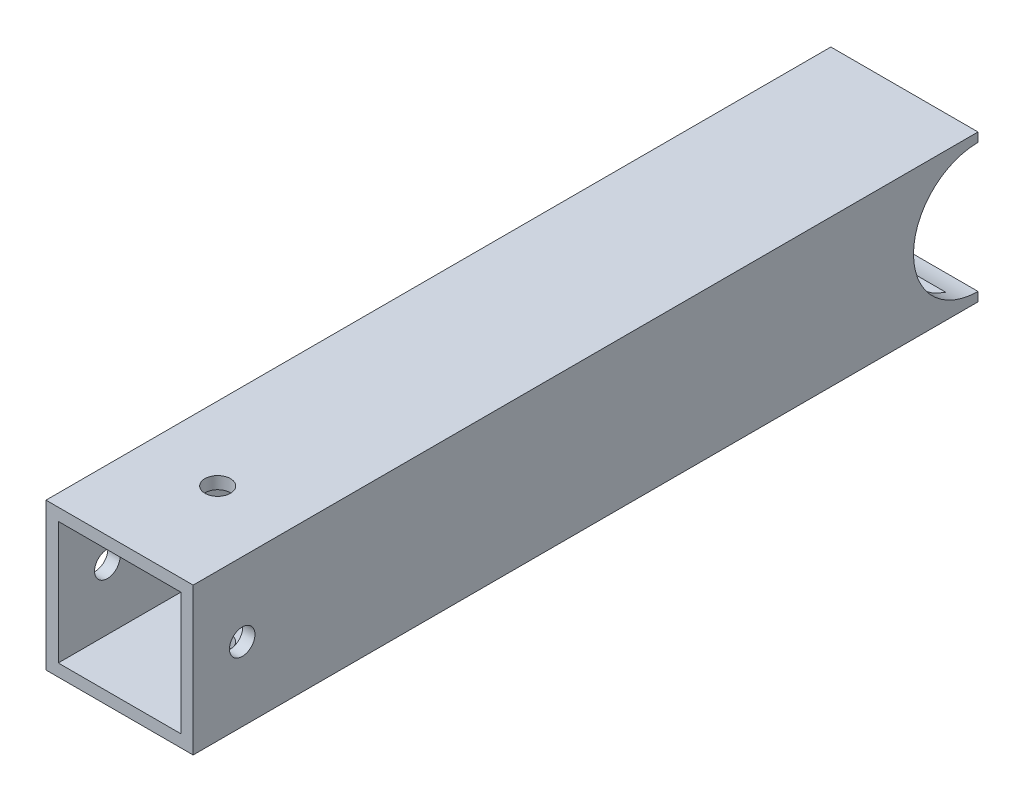
ISO-10303-21;
HEADER;
FILE_DESCRIPTION(('STEP AP214'),'2;1');
FILE_NAME('part.step','',(''),(''),'','','');
FILE_SCHEMA(('AUTOMOTIVE_DESIGN { 1 0 10303 214 1 1 1 1 }'));
ENDSEC;
DATA;
#1=APPLICATION_CONTEXT('core data for automotive mechanical design processes');
#2=APPLICATION_PROTOCOL_DEFINITION('international standard','automotive_design',2000,#1);
#3=PRODUCT_CONTEXT('',#1,'mechanical');
#4=PRODUCT('Part','Part','',(#3));
#5=PRODUCT_RELATED_PRODUCT_CATEGORY('part','',(#4));
#6=PRODUCT_DEFINITION_FORMATION('','',#4);
#7=PRODUCT_DEFINITION_CONTEXT('part definition',#1,'design');
#8=PRODUCT_DEFINITION('design','',#6,#7);
#9=PRODUCT_DEFINITION_SHAPE('','',#8);
#10=(LENGTH_UNIT() NAMED_UNIT(*) SI_UNIT(.MILLI.,.METRE.));
#11=(NAMED_UNIT(*) PLANE_ANGLE_UNIT() SI_UNIT($,.RADIAN.));
#12=(NAMED_UNIT(*) SI_UNIT($,.STERADIAN.) SOLID_ANGLE_UNIT());
#13=UNCERTAINTY_MEASURE_WITH_UNIT(LENGTH_MEASURE(1.E-05),#10,'distance_accuracy_value','');
#14=(GEOMETRIC_REPRESENTATION_CONTEXT(3) GLOBAL_UNCERTAINTY_ASSIGNED_CONTEXT((#13)) GLOBAL_UNIT_ASSIGNED_CONTEXT((#10,
#11,#12)) REPRESENTATION_CONTEXT('',''));
#15=CARTESIAN_POINT('',(0.,0.,0.));
#16=DIRECTION('',(0.,0.,1.));
#17=DIRECTION('',(1.,0.,0.));
#18=AXIS2_PLACEMENT_3D('',#15,#16,#17);
#19=CARTESIAN_POINT('',(0.,22.86,76.2));
#20=DIRECTION('',(0.,-1.,0.));
#21=DIRECTION('',(0.,0.,-1.));
#22=AXIS2_PLACEMENT_3D('',#19,#20,#21);
#23=CYLINDRICAL_SURFACE('',#22,3.302);
#24=CARTESIAN_POINT('',(0.,15.875,76.2));
#25=DIRECTION('',(0.,-1.,0.));
#26=DIRECTION('',(0.,0.,-1.));
#27=AXIS2_PLACEMENT_3D('',#24,#25,#26);
#28=CIRCLE('',#27,3.302);
#29=CARTESIAN_POINT('',(0.,15.875,72.898));
#30=VERTEX_POINT('',#29);
#31=EDGE_CURVE('E130',#30,#30,#28,.F.);
#32=ORIENTED_EDGE('',*,*,#31,.F.);
#33=EDGE_LOOP('',(#32));
#34=FACE_BOUND('',#33,.T.);
#35=CARTESIAN_POINT('',(0.,19.05,76.2));
#36=DIRECTION('',(0.,-1.,0.));
#37=DIRECTION('',(0.,0.,-1.));
#38=AXIS2_PLACEMENT_3D('',#35,#36,#37);
#39=CIRCLE('',#38,3.302);
#40=CARTESIAN_POINT('',(0.,19.05,72.898));
#41=VERTEX_POINT('',#40);
#42=EDGE_CURVE('E128',#41,#41,#39,.T.);
#43=ORIENTED_EDGE('',*,*,#42,.F.);
#44=EDGE_LOOP('',(#43));
#45=FACE_BOUND('',#44,.T.);
#46=ADVANCED_FACE('F17',(#34,#45),#23,.F.);
#47=CARTESIAN_POINT('',(22.86,0.,88.9));
#48=DIRECTION('',(-1.,0.,0.));
#49=DIRECTION('',(0.,0.,1.));
#50=AXIS2_PLACEMENT_3D('',#47,#48,#49);
#51=CYLINDRICAL_SURFACE('',#50,3.302);
#52=CARTESIAN_POINT('',(15.875,0.,88.9));
#53=DIRECTION('',(-1.,0.,0.));
#54=DIRECTION('',(0.,0.,1.));
#55=AXIS2_PLACEMENT_3D('',#52,#53,#54);
#56=CIRCLE('',#55,3.302);
#57=CARTESIAN_POINT('',(15.875,0.,92.202));
#58=VERTEX_POINT('',#57);
#59=EDGE_CURVE('E20',#58,#58,#56,.F.);
#60=ORIENTED_EDGE('',*,*,#59,.F.);
#61=EDGE_LOOP('',(#60));
#62=FACE_BOUND('',#61,.T.);
#63=CARTESIAN_POINT('',(19.05,0.,88.9));
#64=DIRECTION('',(-1.,0.,0.));
#65=DIRECTION('',(0.,0.,1.));
#66=AXIS2_PLACEMENT_3D('',#63,#64,#65);
#67=CIRCLE('',#66,3.302);
#68=CARTESIAN_POINT('',(19.05,0.,92.202));
#69=VERTEX_POINT('',#68);
#70=EDGE_CURVE('E161',#69,#69,#67,.T.);
#71=ORIENTED_EDGE('',*,*,#70,.F.);
#72=EDGE_LOOP('',(#71));
#73=FACE_BOUND('',#72,.T.);
#74=ADVANCED_FACE('F338',(#62,#73),#51,.F.);
#75=CARTESIAN_POINT('',(15.875,15.875,-101.6));
#76=DIRECTION('',(-1.,0.,0.));
#77=DIRECTION('',(0.,0.,1.));
#78=AXIS2_PLACEMENT_3D('',#75,#76,#77);
#79=PLANE('',#78);
#80=ORIENTED_EDGE('',*,*,#59,.T.);
#81=EDGE_LOOP('',(#80));
#82=FACE_BOUND('',#81,.T.);
#83=DIRECTION('',(0.,0.,-1.));
#84=VECTOR('',#83,1.);
#85=CARTESIAN_POINT('',(15.875,15.875,-101.6));
#86=LINE('',#85,#84);
#87=CARTESIAN_POINT('',(15.875,15.8750000000009,-96.4143394586638));
#88=VERTEX_POINT('',#87);
#89=CARTESIAN_POINT('',(15.875,15.875,101.6));
#90=VERTEX_POINT('',#89);
#91=EDGE_CURVE('E91',#88,#90,#86,.F.);
#92=ORIENTED_EDGE('',*,*,#91,.F.);
#93=CARTESIAN_POINT('',(15.875,0.,-101.6));
#94=DIRECTION('',(1.,0.,0.));
#95=DIRECTION('',(0.,0.,-1.));
#96=AXIS2_PLACEMENT_3D('',#93,#94,#95);
#97=CIRCLE('',#96,16.7005);
#98=CARTESIAN_POINT('',(15.875,-15.875,-96.4143394586641));
#99=VERTEX_POINT('',#98);
#100=EDGE_CURVE('E95',#88,#99,#97,.T.);
#101=ORIENTED_EDGE('',*,*,#100,.T.);
#102=DIRECTION('',(0.,0.,1.));
#103=VECTOR('',#102,1.);
#104=CARTESIAN_POINT('',(15.875,-15.875,-101.6));
#105=LINE('',#104,#103);
#106=CARTESIAN_POINT('',(15.875,-15.875,101.6));
#107=VERTEX_POINT('',#106);
#108=EDGE_CURVE('E182',#107,#99,#105,.F.);
#109=ORIENTED_EDGE('',*,*,#108,.F.);
#110=DIRECTION('',(0.,1.,0.));
#111=VECTOR('',#110,1.);
#112=CARTESIAN_POINT('',(15.875,0.,101.6));
#113=LINE('',#112,#111);
#114=EDGE_CURVE('E98',#90,#107,#113,.F.);
#115=ORIENTED_EDGE('',*,*,#114,.F.);
#116=EDGE_LOOP('',(#92,#101,#109,#115));
#117=FACE_BOUND('',#116,.T.);
#118=ADVANCED_FACE('F93',(#82,#117),#79,.T.);
#119=CARTESIAN_POINT('',(-15.875,-15.875,-101.6));
#120=DIRECTION('',(1.,0.,0.));
#121=DIRECTION('',(0.,0.,-1.));
#122=AXIS2_PLACEMENT_3D('',#119,#120,#121);
#123=PLANE('',#122);
#124=CARTESIAN_POINT('',(-15.875,0.,88.9));
#125=DIRECTION('',(-1.,0.,0.));
#126=DIRECTION('',(0.,0.,1.));
#127=AXIS2_PLACEMENT_3D('',#124,#125,#126);
#128=CIRCLE('',#127,3.302);
#129=CARTESIAN_POINT('',(-15.875,0.,92.202));
#130=VERTEX_POINT('',#129);
#131=EDGE_CURVE('E121',#130,#130,#128,.T.);
#132=ORIENTED_EDGE('',*,*,#131,.T.);
#133=EDGE_LOOP('',(#132));
#134=FACE_BOUND('',#133,.T.);
#135=DIRECTION('',(0.,0.,1.));
#136=VECTOR('',#135,1.);
#137=CARTESIAN_POINT('',(-15.875,-15.875,-101.6));
#138=LINE('',#137,#136);
#139=CARTESIAN_POINT('',(-15.875,-15.875,-96.4143394586641));
#140=VERTEX_POINT('',#139);
#141=CARTESIAN_POINT('',(-15.875,-15.875,101.6));
#142=VERTEX_POINT('',#141);
#143=EDGE_CURVE('E110',#140,#142,#138,.T.);
#144=ORIENTED_EDGE('',*,*,#143,.F.);
#145=CARTESIAN_POINT('',(-15.875,0.,-101.6));
#146=DIRECTION('',(1.,0.,0.));
#147=DIRECTION('',(0.,0.,-1.));
#148=AXIS2_PLACEMENT_3D('',#145,#146,#147);
#149=CIRCLE('',#148,16.7005);
#150=CARTESIAN_POINT('',(-15.875,15.8750000000009,-96.4143394586638));
#151=VERTEX_POINT('',#150);
#152=EDGE_CURVE('E111',#140,#151,#149,.F.);
#153=ORIENTED_EDGE('',*,*,#152,.T.);
#154=DIRECTION('',(0.,0.,-1.));
#155=VECTOR('',#154,1.);
#156=CARTESIAN_POINT('',(-15.875,15.875,-101.6));
#157=LINE('',#156,#155);
#158=CARTESIAN_POINT('',(-15.875,15.875,101.6));
#159=VERTEX_POINT('',#158);
#160=EDGE_CURVE('E102',#159,#151,#157,.T.);
#161=ORIENTED_EDGE('',*,*,#160,.F.);
#162=DIRECTION('',(0.,1.,0.));
#163=VECTOR('',#162,1.);
#164=CARTESIAN_POINT('',(-15.875,0.,101.6));
#165=LINE('',#164,#163);
#166=EDGE_CURVE('E146',#142,#159,#165,.T.);
#167=ORIENTED_EDGE('',*,*,#166,.F.);
#168=EDGE_LOOP('',(#144,#153,#161,#167));
#169=FACE_BOUND('',#168,.T.);
#170=ADVANCED_FACE('F204',(#134,#169),#123,.T.);
#171=CARTESIAN_POINT('',(-15.875,15.875,-101.6));
#172=DIRECTION('',(0.,-1.,0.));
#173=DIRECTION('',(0.,0.,-1.));
#174=AXIS2_PLACEMENT_3D('',#171,#172,#173);
#175=PLANE('',#174);
#176=ORIENTED_EDGE('',*,*,#31,.T.);
#177=EDGE_LOOP('',(#176));
#178=FACE_BOUND('',#177,.T.);
#179=ORIENTED_EDGE('',*,*,#160,.T.);
#180=DIRECTION('',(1.,0.,0.));
#181=VECTOR('',#180,1.);
#182=CARTESIAN_POINT('',(19.05,15.8750000000018,-96.4143394586666));
#183=LINE('',#182,#181);
#184=EDGE_CURVE('E106',#151,#88,#183,.T.);
#185=ORIENTED_EDGE('',*,*,#184,.T.);
#186=ORIENTED_EDGE('',*,*,#91,.T.);
#187=DIRECTION('',(1.,0.,0.));
#188=VECTOR('',#187,1.);
#189=CARTESIAN_POINT('',(0.,15.875,101.6));
#190=LINE('',#189,#188);
#191=EDGE_CURVE('E143',#159,#90,#190,.T.);
#192=ORIENTED_EDGE('',*,*,#191,.F.);
#193=EDGE_LOOP('',(#179,#185,#186,#192));
#194=FACE_BOUND('',#193,.T.);
#195=ADVANCED_FACE('F107',(#178,#194),#175,.T.);
#196=CARTESIAN_POINT('',(19.05,19.05,-101.6));
#197=DIRECTION('',(0.,1.,0.));
#198=DIRECTION('',(0.,0.,1.));
#199=AXIS2_PLACEMENT_3D('',#196,#197,#198);
#200=PLANE('',#199);
#201=ORIENTED_EDGE('',*,*,#42,.T.);
#202=EDGE_LOOP('',(#201));
#203=FACE_BOUND('',#202,.T.);
#204=DIRECTION('',(0.,0.,-1.));
#205=VECTOR('',#204,1.);
#206=CARTESIAN_POINT('',(19.05,19.05,-101.6));
#207=LINE('',#206,#205);
#208=CARTESIAN_POINT('',(19.05,19.05,-101.6));
#209=VERTEX_POINT('',#208);
#210=CARTESIAN_POINT('',(19.05,19.05,101.6));
#211=VERTEX_POINT('',#210);
#212=EDGE_CURVE('E166',#209,#211,#207,.F.);
#213=ORIENTED_EDGE('',*,*,#212,.F.);
#214=DIRECTION('',(1.,0.,0.));
#215=VECTOR('',#214,1.);
#216=CARTESIAN_POINT('',(0.,19.05,-101.6));
#217=LINE('',#216,#215);
#218=CARTESIAN_POINT('',(-19.05,19.05,-101.6));
#219=VERTEX_POINT('',#218);
#220=EDGE_CURVE('E127',#209,#219,#217,.F.);
#221=ORIENTED_EDGE('',*,*,#220,.T.);
#222=DIRECTION('',(0.,0.,1.));
#223=VECTOR('',#222,1.);
#224=CARTESIAN_POINT('',(-19.05,19.05,-101.6));
#225=LINE('',#224,#223);
#226=CARTESIAN_POINT('',(-19.05,19.05,101.6));
#227=VERTEX_POINT('',#226);
#228=EDGE_CURVE('E376',#227,#219,#225,.F.);
#229=ORIENTED_EDGE('',*,*,#228,.F.);
#230=DIRECTION('',(1.,0.,0.));
#231=VECTOR('',#230,1.);
#232=CARTESIAN_POINT('',(0.,19.05,101.6));
#233=LINE('',#232,#231);
#234=EDGE_CURVE('E192',#211,#227,#233,.F.);
#235=ORIENTED_EDGE('',*,*,#234,.F.);
#236=EDGE_LOOP('',(#213,#221,#229,#235));
#237=FACE_BOUND('',#236,.T.);
#238=ADVANCED_FACE('F306',(#203,#237),#200,.T.);
#239=CARTESIAN_POINT('',(0.,0.,-101.6));
#240=DIRECTION('',(0.,0.,1.));
#241=DIRECTION('',(1.,0.,0.));
#242=AXIS2_PLACEMENT_3D('',#239,#240,#241);
#243=PLANE('',#242);
#244=ORIENTED_EDGE('',*,*,#220,.F.);
#245=DIRECTION('',(0.,1.,0.));
#246=VECTOR('',#245,1.);
#247=CARTESIAN_POINT('',(19.05,-19.05,-101.6));
#248=LINE('',#247,#246);
#249=CARTESIAN_POINT('',(19.05,16.7005,-101.6));
#250=VERTEX_POINT('',#249);
#251=EDGE_CURVE('E170',#250,#209,#248,.T.);
#252=ORIENTED_EDGE('',*,*,#251,.F.);
#253=DIRECTION('',(1.,0.,0.));
#254=VECTOR('',#253,1.);
#255=CARTESIAN_POINT('',(19.05,16.7005,-101.6));
#256=LINE('',#255,#254);
#257=CARTESIAN_POINT('',(-19.05,16.7005,-101.6));
#258=VERTEX_POINT('',#257);
#259=EDGE_CURVE('E118',#250,#258,#256,.F.);
#260=ORIENTED_EDGE('',*,*,#259,.T.);
#261=DIRECTION('',(0.,1.,0.));
#262=VECTOR('',#261,1.);
#263=CARTESIAN_POINT('',(-19.05,19.05,-101.6));
#264=LINE('',#263,#262);
#265=EDGE_CURVE('E160',#219,#258,#264,.F.);
#266=ORIENTED_EDGE('',*,*,#265,.F.);
#267=EDGE_LOOP('',(#244,#252,#260,#266));
#268=FACE_BOUND('',#267,.T.);
#269=ADVANCED_FACE('F297',(#268),#243,.F.);
#270=CARTESIAN_POINT('',(22.86,0.,88.9));
#271=DIRECTION('',(-1.,0.,0.));
#272=DIRECTION('',(0.,0.,1.));
#273=AXIS2_PLACEMENT_3D('',#270,#271,#272);
#274=CYLINDRICAL_SURFACE('',#273,3.302);
#275=ORIENTED_EDGE('',*,*,#131,.F.);
#276=EDGE_LOOP('',(#275));
#277=FACE_BOUND('',#276,.T.);
#278=CARTESIAN_POINT('',(-19.05,0.,88.9));
#279=DIRECTION('',(-1.,0.,0.));
#280=DIRECTION('',(0.,0.,1.));
#281=AXIS2_PLACEMENT_3D('',#278,#279,#280);
#282=CIRCLE('',#281,3.302);
#283=CARTESIAN_POINT('',(-19.05,0.,92.202));
#284=VERTEX_POINT('',#283);
#285=EDGE_CURVE('E154',#284,#284,#282,.F.);
#286=ORIENTED_EDGE('',*,*,#285,.F.);
#287=EDGE_LOOP('',(#286));
#288=FACE_BOUND('',#287,.T.);
#289=ADVANCED_FACE('F218',(#277,#288),#274,.F.);
#290=CARTESIAN_POINT('',(19.05,0.,-101.6));
#291=DIRECTION('',(1.,0.,0.));
#292=DIRECTION('',(0.,0.,-1.));
#293=AXIS2_PLACEMENT_3D('',#290,#291,#292);
#294=CYLINDRICAL_SURFACE('',#293,16.7005);
#295=ORIENTED_EDGE('',*,*,#152,.F.);
#296=DIRECTION('',(1.,0.,0.));
#297=VECTOR('',#296,1.);
#298=CARTESIAN_POINT('',(15.875,-15.875,-96.4143394586672));
#299=LINE('',#298,#297);
#300=EDGE_CURVE('E116',#99,#140,#299,.F.);
#301=ORIENTED_EDGE('',*,*,#300,.F.);
#302=ORIENTED_EDGE('',*,*,#100,.F.);
#303=ORIENTED_EDGE('',*,*,#184,.F.);
#304=EDGE_LOOP('',(#295,#301,#302,#303));
#305=FACE_BOUND('',#304,.T.);
#306=CARTESIAN_POINT('',(19.05,0.,-101.6));
#307=DIRECTION('',(1.,0.,0.));
#308=DIRECTION('',(0.,0.,-1.));
#309=AXIS2_PLACEMENT_3D('',#306,#307,#308);
#310=CIRCLE('',#309,16.7005);
#311=CARTESIAN_POINT('',(19.05,-16.7005,-101.6));
#312=VERTEX_POINT('',#311);
#313=EDGE_CURVE('E164',#312,#250,#310,.F.);
#314=ORIENTED_EDGE('',*,*,#313,.F.);
#315=DIRECTION('',(1.,0.,0.));
#316=VECTOR('',#315,1.);
#317=CARTESIAN_POINT('',(0.,-16.7005,-101.6));
#318=LINE('',#317,#316);
#319=CARTESIAN_POINT('',(-19.05,-16.7005,-101.6));
#320=VERTEX_POINT('',#319);
#321=EDGE_CURVE('E157',#312,#320,#318,.F.);
#322=ORIENTED_EDGE('',*,*,#321,.T.);
#323=CARTESIAN_POINT('',(-19.05,0.,-101.6));
#324=DIRECTION('',(1.,0.,0.));
#325=DIRECTION('',(0.,0.,-1.));
#326=AXIS2_PLACEMENT_3D('',#323,#324,#325);
#327=CIRCLE('',#326,16.7005);
#328=EDGE_CURVE('E158',#258,#320,#327,.T.);
#329=ORIENTED_EDGE('',*,*,#328,.F.);
#330=ORIENTED_EDGE('',*,*,#259,.F.);
#331=EDGE_LOOP('',(#314,#322,#329,#330));
#332=FACE_BOUND('',#331,.T.);
#333=ADVANCED_FACE('F113',(#305,#332),#294,.F.);
#334=CARTESIAN_POINT('',(15.875,-15.875,-101.6));
#335=DIRECTION('',(0.,1.,0.));
#336=DIRECTION('',(0.,0.,1.));
#337=AXIS2_PLACEMENT_3D('',#334,#335,#336);
#338=PLANE('',#337);
#339=CARTESIAN_POINT('',(0.,-15.875,76.2));
#340=DIRECTION('',(0.,-1.,0.));
#341=DIRECTION('',(0.,0.,-1.));
#342=AXIS2_PLACEMENT_3D('',#339,#340,#341);
#343=CIRCLE('',#342,3.302);
#344=CARTESIAN_POINT('',(0.,-15.875,72.898));
#345=VERTEX_POINT('',#344);
#346=EDGE_CURVE('E149',#345,#345,#343,.T.);
#347=ORIENTED_EDGE('',*,*,#346,.T.);
#348=EDGE_LOOP('',(#347));
#349=FACE_BOUND('',#348,.T.);
#350=ORIENTED_EDGE('',*,*,#108,.T.);
#351=ORIENTED_EDGE('',*,*,#300,.T.);
#352=ORIENTED_EDGE('',*,*,#143,.T.);
#353=DIRECTION('',(1.,0.,0.));
#354=VECTOR('',#353,1.);
#355=CARTESIAN_POINT('',(0.,-15.875,101.6));
#356=LINE('',#355,#354);
#357=EDGE_CURVE('E186',#107,#142,#356,.F.);
#358=ORIENTED_EDGE('',*,*,#357,.F.);
#359=EDGE_LOOP('',(#350,#351,#352,#358));
#360=FACE_BOUND('',#359,.T.);
#361=ADVANCED_FACE('F206',(#349,#360),#338,.T.);
#362=CARTESIAN_POINT('',(19.05,-19.05,-101.6));
#363=DIRECTION('',(1.,0.,0.));
#364=DIRECTION('',(0.,0.,-1.));
#365=AXIS2_PLACEMENT_3D('',#362,#363,#364);
#366=PLANE('',#365);
#367=ORIENTED_EDGE('',*,*,#70,.T.);
#368=EDGE_LOOP('',(#367));
#369=FACE_BOUND('',#368,.T.);
#370=DIRECTION('',(0.,1.,0.));
#371=VECTOR('',#370,1.);
#372=CARTESIAN_POINT('',(19.05,0.,-101.6));
#373=LINE('',#372,#371);
#374=CARTESIAN_POINT('',(19.05,-19.05,-101.6));
#375=VERTEX_POINT('',#374);
#376=EDGE_CURVE('E153',#375,#312,#373,.T.);
#377=ORIENTED_EDGE('',*,*,#376,.T.);
#378=ORIENTED_EDGE('',*,*,#313,.T.);
#379=ORIENTED_EDGE('',*,*,#251,.T.);
#380=ORIENTED_EDGE('',*,*,#212,.T.);
#381=DIRECTION('',(0.,1.,0.));
#382=VECTOR('',#381,1.);
#383=CARTESIAN_POINT('',(19.05,0.,101.6));
#384=LINE('',#383,#382);
#385=CARTESIAN_POINT('',(19.05,-19.05,101.6));
#386=VERTEX_POINT('',#385);
#387=EDGE_CURVE('E163',#386,#211,#384,.T.);
#388=ORIENTED_EDGE('',*,*,#387,.F.);
#389=DIRECTION('',(0.,0.,-1.));
#390=VECTOR('',#389,1.);
#391=CARTESIAN_POINT('',(19.05,-19.05,-101.6));
#392=LINE('',#391,#390);
#393=EDGE_CURVE('E152',#375,#386,#392,.F.);
#394=ORIENTED_EDGE('',*,*,#393,.F.);
#395=EDGE_LOOP('',(#377,#378,#379,#380,#388,#394));
#396=FACE_BOUND('',#395,.T.);
#397=ADVANCED_FACE('F208',(#369,#396),#366,.T.);
#398=CARTESIAN_POINT('',(0.,0.,101.6));
#399=DIRECTION('',(0.,0.,1.));
#400=DIRECTION('',(1.,0.,0.));
#401=AXIS2_PLACEMENT_3D('',#398,#399,#400);
#402=PLANE('',#401);
#403=ORIENTED_EDGE('',*,*,#166,.T.);
#404=ORIENTED_EDGE('',*,*,#191,.T.);
#405=ORIENTED_EDGE('',*,*,#114,.T.);
#406=ORIENTED_EDGE('',*,*,#357,.T.);
#407=EDGE_LOOP('',(#403,#404,#405,#406));
#408=FACE_BOUND('',#407,.T.);
#409=ORIENTED_EDGE('',*,*,#234,.T.);
#410=DIRECTION('',(0.,1.,0.));
#411=VECTOR('',#410,1.);
#412=CARTESIAN_POINT('',(-19.05,19.05,101.6));
#413=LINE('',#412,#411);
#414=CARTESIAN_POINT('',(-19.05,-19.05,101.6));
#415=VERTEX_POINT('',#414);
#416=EDGE_CURVE('E145',#415,#227,#413,.T.);
#417=ORIENTED_EDGE('',*,*,#416,.F.);
#418=DIRECTION('',(1.,0.,0.));
#419=VECTOR('',#418,1.);
#420=CARTESIAN_POINT('',(-19.05,-19.05,101.6));
#421=LINE('',#420,#419);
#422=EDGE_CURVE('E390',#386,#415,#421,.F.);
#423=ORIENTED_EDGE('',*,*,#422,.F.);
#424=ORIENTED_EDGE('',*,*,#387,.T.);
#425=EDGE_LOOP('',(#409,#417,#423,#424));
#426=FACE_BOUND('',#425,.T.);
#427=ADVANCED_FACE('F200',(#408,#426),#402,.T.);
#428=CARTESIAN_POINT('',(-19.05,19.05,-101.6));
#429=DIRECTION('',(-1.,0.,0.));
#430=DIRECTION('',(0.,0.,1.));
#431=AXIS2_PLACEMENT_3D('',#428,#429,#430);
#432=PLANE('',#431);
#433=ORIENTED_EDGE('',*,*,#285,.T.);
#434=EDGE_LOOP('',(#433));
#435=FACE_BOUND('',#434,.T.);
#436=ORIENTED_EDGE('',*,*,#265,.T.);
#437=ORIENTED_EDGE('',*,*,#328,.T.);
#438=DIRECTION('',(0.,1.,0.));
#439=VECTOR('',#438,1.);
#440=CARTESIAN_POINT('',(-19.05,0.,-101.6));
#441=LINE('',#440,#439);
#442=CARTESIAN_POINT('',(-19.05,-19.05,-101.6));
#443=VERTEX_POINT('',#442);
#444=EDGE_CURVE('E35',#320,#443,#441,.F.);
#445=ORIENTED_EDGE('',*,*,#444,.T.);
#446=DIRECTION('',(0.,0.,-1.));
#447=VECTOR('',#446,1.);
#448=CARTESIAN_POINT('',(-19.05,-19.05,-101.6));
#449=LINE('',#448,#447);
#450=EDGE_CURVE('E395',#415,#443,#449,.T.);
#451=ORIENTED_EDGE('',*,*,#450,.F.);
#452=ORIENTED_EDGE('',*,*,#416,.T.);
#453=ORIENTED_EDGE('',*,*,#228,.T.);
#454=EDGE_LOOP('',(#436,#437,#445,#451,#452,#453));
#455=FACE_BOUND('',#454,.T.);
#456=ADVANCED_FACE('F235',(#435,#455),#432,.T.);
#457=CARTESIAN_POINT('',(0.,0.,-101.6));
#458=DIRECTION('',(0.,0.,1.));
#459=DIRECTION('',(1.,0.,0.));
#460=AXIS2_PLACEMENT_3D('',#457,#458,#459);
#461=PLANE('',#460);
#462=DIRECTION('',(1.,0.,0.));
#463=VECTOR('',#462,1.);
#464=CARTESIAN_POINT('',(-19.05,-19.05,-101.6));
#465=LINE('',#464,#463);
#466=EDGE_CURVE('E26',#443,#375,#465,.T.);
#467=ORIENTED_EDGE('',*,*,#466,.F.);
#468=ORIENTED_EDGE('',*,*,#444,.F.);
#469=ORIENTED_EDGE('',*,*,#321,.F.);
#470=ORIENTED_EDGE('',*,*,#376,.F.);
#471=EDGE_LOOP('',(#467,#468,#469,#470));
#472=FACE_BOUND('',#471,.T.);
#473=ADVANCED_FACE('F228',(#472),#461,.F.);
#474=CARTESIAN_POINT('',(0.,22.86,76.2));
#475=DIRECTION('',(0.,-1.,0.));
#476=DIRECTION('',(0.,0.,-1.));
#477=AXIS2_PLACEMENT_3D('',#474,#475,#476);
#478=CYLINDRICAL_SURFACE('',#477,3.302);
#479=ORIENTED_EDGE('',*,*,#346,.F.);
#480=EDGE_LOOP('',(#479));
#481=FACE_BOUND('',#480,.T.);
#482=CARTESIAN_POINT('',(0.,-19.05,76.2));
#483=DIRECTION('',(0.,-1.,0.));
#484=DIRECTION('',(0.,0.,-1.));
#485=AXIS2_PLACEMENT_3D('',#482,#483,#484);
#486=CIRCLE('',#485,3.302);
#487=CARTESIAN_POINT('',(0.,-19.05,72.898));
#488=VERTEX_POINT('',#487);
#489=EDGE_CURVE('E11',#488,#488,#486,.F.);
#490=ORIENTED_EDGE('',*,*,#489,.F.);
#491=EDGE_LOOP('',(#490));
#492=FACE_BOUND('',#491,.T.);
#493=ADVANCED_FACE('F222',(#481,#492),#478,.F.);
#494=CARTESIAN_POINT('',(-19.05,-19.05,-101.6));
#495=DIRECTION('',(0.,-1.,0.));
#496=DIRECTION('',(0.,0.,-1.));
#497=AXIS2_PLACEMENT_3D('',#494,#495,#496);
#498=PLANE('',#497);
#499=ORIENTED_EDGE('',*,*,#489,.T.);
#500=EDGE_LOOP('',(#499));
#501=FACE_BOUND('',#500,.T.);
#502=ORIENTED_EDGE('',*,*,#450,.T.);
#503=ORIENTED_EDGE('',*,*,#466,.T.);
#504=ORIENTED_EDGE('',*,*,#393,.T.);
#505=ORIENTED_EDGE('',*,*,#422,.T.);
#506=EDGE_LOOP('',(#502,#503,#504,#505));
#507=FACE_BOUND('',#506,.T.);
#508=ADVANCED_FACE('F220',(#501,#507),#498,.T.);
#509=CLOSED_SHELL('',(#46,#74,#118,#170,#195,#238,#269,#289,#333,#361,#397,#427,#456,#473,#493,#508));
#510=MANIFOLD_SOLID_BREP('B1',#509);
#511=ADVANCED_BREP_SHAPE_REPRESENTATION('',(#18,#510),#14);
#512=SHAPE_DEFINITION_REPRESENTATION(#9,#511);
ENDSEC;
END-ISO-10303-21;
